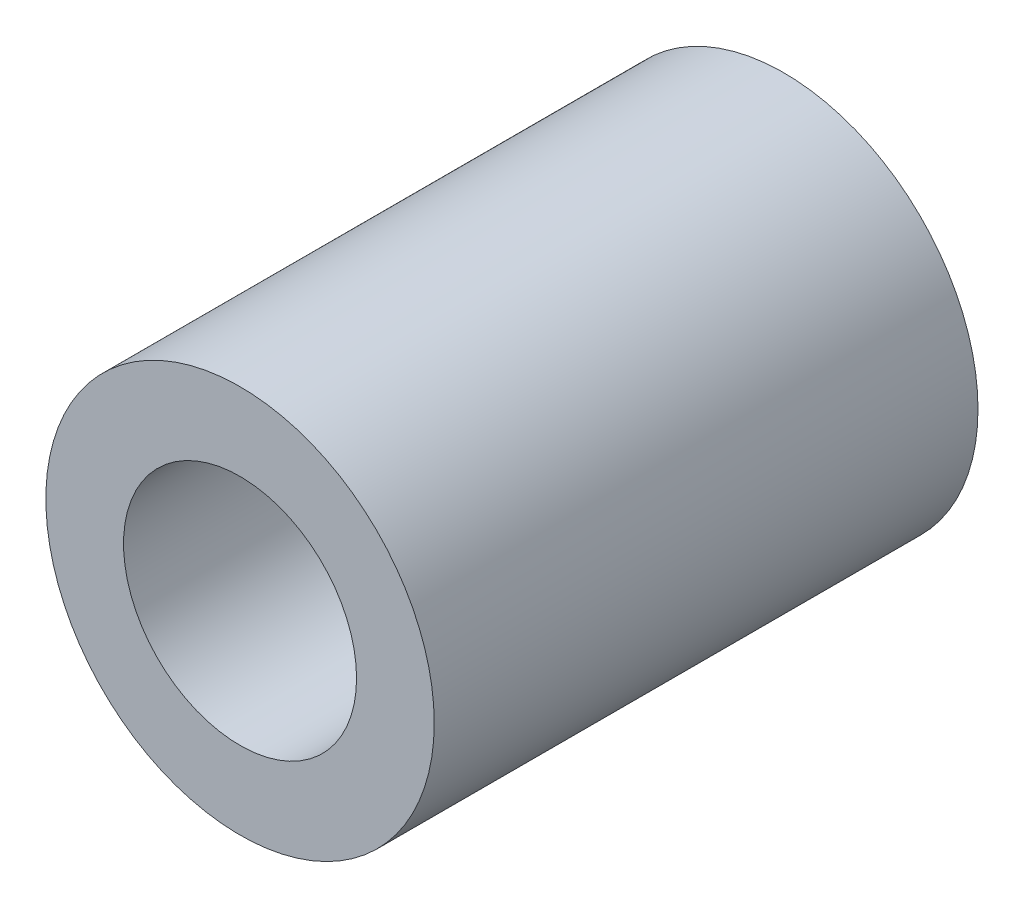
ISO-10303-21;
HEADER;
FILE_DESCRIPTION(('STEP AP214'),'2;1');
FILE_NAME('part.step','',(''),(''),'','','');
FILE_SCHEMA(('AUTOMOTIVE_DESIGN { 1 0 10303 214 1 1 1 1 }'));
ENDSEC;
DATA;
#1=APPLICATION_CONTEXT('core data for automotive mechanical design processes');
#2=APPLICATION_PROTOCOL_DEFINITION('international standard','automotive_design',2000,#1);
#3=PRODUCT_CONTEXT('',#1,'mechanical');
#4=PRODUCT('Part','Part','',(#3));
#5=PRODUCT_RELATED_PRODUCT_CATEGORY('part','',(#4));
#6=PRODUCT_DEFINITION_FORMATION('','',#4);
#7=PRODUCT_DEFINITION_CONTEXT('part definition',#1,'design');
#8=PRODUCT_DEFINITION('design','',#6,#7);
#9=PRODUCT_DEFINITION_SHAPE('','',#8);
#10=(LENGTH_UNIT() NAMED_UNIT(*) SI_UNIT(.MILLI.,.METRE.));
#11=(NAMED_UNIT(*) PLANE_ANGLE_UNIT() SI_UNIT($,.RADIAN.));
#12=(NAMED_UNIT(*) SI_UNIT($,.STERADIAN.) SOLID_ANGLE_UNIT());
#13=UNCERTAINTY_MEASURE_WITH_UNIT(LENGTH_MEASURE(1.E-05),#10,'distance_accuracy_value','');
#14=(GEOMETRIC_REPRESENTATION_CONTEXT(3) GLOBAL_UNCERTAINTY_ASSIGNED_CONTEXT((#13)) GLOBAL_UNIT_ASSIGNED_CONTEXT((#10,
#11,#12)) REPRESENTATION_CONTEXT('',''));
#15=CARTESIAN_POINT('',(0.,0.,0.));
#16=DIRECTION('',(0.,0.,1.));
#17=DIRECTION('',(1.,0.,0.));
#18=AXIS2_PLACEMENT_3D('',#15,#16,#17);
#19=CARTESIAN_POINT('',(0.,0.,7.));
#20=DIRECTION('',(0.,0.,1.));
#21=DIRECTION('',(1.,0.,0.));
#22=AXIS2_PLACEMENT_3D('',#19,#20,#21);
#23=PLANE('',#22);
#24=CARTESIAN_POINT('',(0.,0.,7.));
#25=DIRECTION('',(0.,0.,1.));
#26=DIRECTION('',(1.,0.,0.));
#27=AXIS2_PLACEMENT_3D('',#24,#25,#26);
#28=CIRCLE('',#27,2.5);
#29=CARTESIAN_POINT('',(2.5,0.,7.));
#30=VERTEX_POINT('',#29);
#31=EDGE_CURVE('E10',#30,#30,#28,.T.);
#32=ORIENTED_EDGE('',*,*,#31,.T.);
#33=EDGE_LOOP('',(#32));
#34=FACE_BOUND('',#33,.T.);
#35=CARTESIAN_POINT('',(0.,0.,7.));
#36=DIRECTION('',(0.,0.,1.));
#37=DIRECTION('',(1.,0.,0.));
#38=AXIS2_PLACEMENT_3D('',#35,#36,#37);
#39=CIRCLE('',#38,1.5);
#40=CARTESIAN_POINT('',(1.5,0.,7.));
#41=VERTEX_POINT('',#40);
#42=EDGE_CURVE('E46',#41,#41,#39,.T.);
#43=ORIENTED_EDGE('',*,*,#42,.F.);
#44=EDGE_LOOP('',(#43));
#45=FACE_BOUND('',#44,.T.);
#46=ADVANCED_FACE('F35',(#34,#45),#23,.T.);
#47=CARTESIAN_POINT('',(0.,0.,0.));
#48=DIRECTION('',(0.,0.,1.));
#49=DIRECTION('',(1.,0.,0.));
#50=AXIS2_PLACEMENT_3D('',#47,#48,#49);
#51=PLANE('',#50);
#52=CARTESIAN_POINT('',(0.,0.,0.));
#53=DIRECTION('',(0.,0.,1.));
#54=DIRECTION('',(1.,0.,0.));
#55=AXIS2_PLACEMENT_3D('',#52,#53,#54);
#56=CIRCLE('',#55,2.5);
#57=CARTESIAN_POINT('',(2.5,0.,0.));
#58=VERTEX_POINT('',#57);
#59=EDGE_CURVE('E39',#58,#58,#56,.T.);
#60=ORIENTED_EDGE('',*,*,#59,.F.);
#61=EDGE_LOOP('',(#60));
#62=FACE_BOUND('',#61,.T.);
#63=CARTESIAN_POINT('',(0.,0.,0.));
#64=DIRECTION('',(0.,0.,1.));
#65=DIRECTION('',(1.,0.,0.));
#66=AXIS2_PLACEMENT_3D('',#63,#64,#65);
#67=CIRCLE('',#66,1.5);
#68=CARTESIAN_POINT('',(1.5,0.,0.));
#69=VERTEX_POINT('',#68);
#70=EDGE_CURVE('E48',#69,#69,#67,.T.);
#71=ORIENTED_EDGE('',*,*,#70,.T.);
#72=EDGE_LOOP('',(#71));
#73=FACE_BOUND('',#72,.T.);
#74=ADVANCED_FACE('F58',(#62,#73),#51,.F.);
#75=CARTESIAN_POINT('',(0.,0.,7.));
#76=DIRECTION('',(0.,0.,-1.));
#77=DIRECTION('',(-1.,0.,0.));
#78=AXIS2_PLACEMENT_3D('',#75,#76,#77);
#79=CYLINDRICAL_SURFACE('',#78,2.5);
#80=ORIENTED_EDGE('',*,*,#31,.F.);
#81=EDGE_LOOP('',(#80));
#82=FACE_BOUND('',#81,.T.);
#83=ORIENTED_EDGE('',*,*,#59,.T.);
#84=EDGE_LOOP('',(#83));
#85=FACE_BOUND('',#84,.T.);
#86=ADVANCED_FACE('F37',(#82,#85),#79,.T.);
#87=CARTESIAN_POINT('',(0.,0.,7.));
#88=DIRECTION('',(0.,0.,-1.));
#89=DIRECTION('',(-1.,0.,0.));
#90=AXIS2_PLACEMENT_3D('',#87,#88,#89);
#91=CYLINDRICAL_SURFACE('',#90,1.5);
#92=ORIENTED_EDGE('',*,*,#42,.T.);
#93=EDGE_LOOP('',(#92));
#94=FACE_BOUND('',#93,.T.);
#95=ORIENTED_EDGE('',*,*,#70,.F.);
#96=EDGE_LOOP('',(#95));
#97=FACE_BOUND('',#96,.T.);
#98=ADVANCED_FACE('F54',(#94,#97),#91,.F.);
#99=CLOSED_SHELL('',(#46,#74,#86,#98));
#100=MANIFOLD_SOLID_BREP('B2',#99);
#101=ADVANCED_BREP_SHAPE_REPRESENTATION('',(#18,#100),#14);
#102=SHAPE_DEFINITION_REPRESENTATION(#9,#101);
ENDSEC;
END-ISO-10303-21;
